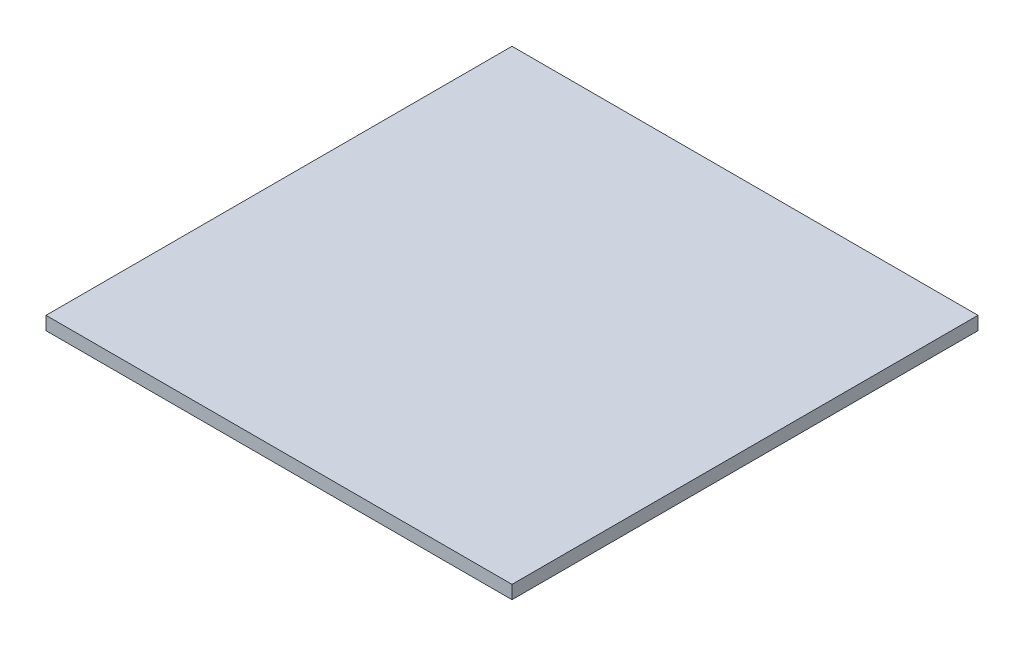
ISO-10303-21;
HEADER;
FILE_DESCRIPTION(('STEP AP214'),'2;1');
FILE_NAME('part.step','',(''),(''),'','','');
FILE_SCHEMA(('AUTOMOTIVE_DESIGN { 1 0 10303 214 1 1 1 1 }'));
ENDSEC;
DATA;
#1=APPLICATION_CONTEXT('core data for automotive mechanical design processes');
#2=APPLICATION_PROTOCOL_DEFINITION('international standard','automotive_design',2000,#1);
#3=PRODUCT_CONTEXT('',#1,'mechanical');
#4=PRODUCT('Part','Part','',(#3));
#5=PRODUCT_RELATED_PRODUCT_CATEGORY('part','',(#4));
#6=PRODUCT_DEFINITION_FORMATION('','',#4);
#7=PRODUCT_DEFINITION_CONTEXT('part definition',#1,'design');
#8=PRODUCT_DEFINITION('design','',#6,#7);
#9=PRODUCT_DEFINITION_SHAPE('','',#8);
#10=(LENGTH_UNIT() NAMED_UNIT(*) SI_UNIT(.MILLI.,.METRE.));
#11=(NAMED_UNIT(*) PLANE_ANGLE_UNIT() SI_UNIT($,.RADIAN.));
#12=(NAMED_UNIT(*) SI_UNIT($,.STERADIAN.) SOLID_ANGLE_UNIT());
#13=UNCERTAINTY_MEASURE_WITH_UNIT(LENGTH_MEASURE(1.E-05),#10,'distance_accuracy_value','');
#14=(GEOMETRIC_REPRESENTATION_CONTEXT(3) GLOBAL_UNCERTAINTY_ASSIGNED_CONTEXT((#13)) GLOBAL_UNIT_ASSIGNED_CONTEXT((#10,
#11,#12)) REPRESENTATION_CONTEXT('',''));
#15=CARTESIAN_POINT('',(0.,0.,0.));
#16=DIRECTION('',(0.,0.,1.));
#17=DIRECTION('',(1.,0.,0.));
#18=AXIS2_PLACEMENT_3D('',#15,#16,#17);
#19=CARTESIAN_POINT('',(0.,10.,0.));
#20=DIRECTION('',(1.,0.,0.));
#21=DIRECTION('',(0.,0.,-1.));
#22=AXIS2_PLACEMENT_3D('',#19,#20,#21);
#23=PLANE('',#22);
#24=DIRECTION('',(0.,0.,1.));
#25=VECTOR('',#24,1.);
#26=CARTESIAN_POINT('',(0.,0.,0.));
#27=LINE('',#26,#25);
#28=CARTESIAN_POINT('',(0.,0.,-350.));
#29=VERTEX_POINT('',#28);
#30=CARTESIAN_POINT('',(0.,0.,0.));
#31=VERTEX_POINT('',#30);
#32=EDGE_CURVE('E94',#29,#31,#27,.T.);
#33=ORIENTED_EDGE('',*,*,#32,.T.);
#34=DIRECTION('',(0.,-1.,0.));
#35=VECTOR('',#34,1.);
#36=CARTESIAN_POINT('',(0.,10.,0.));
#37=LINE('',#36,#35);
#38=CARTESIAN_POINT('',(0.,10.,0.));
#39=VERTEX_POINT('',#38);
#40=EDGE_CURVE('E11',#39,#31,#37,.T.);
#41=ORIENTED_EDGE('',*,*,#40,.F.);
#42=DIRECTION('',(0.,0.,1.));
#43=VECTOR('',#42,1.);
#44=CARTESIAN_POINT('',(0.,10.,0.));
#45=LINE('',#44,#43);
#46=CARTESIAN_POINT('',(0.,10.,-350.));
#47=VERTEX_POINT('',#46);
#48=EDGE_CURVE('E82',#47,#39,#45,.T.);
#49=ORIENTED_EDGE('',*,*,#48,.F.);
#50=DIRECTION('',(0.,-1.,0.));
#51=VECTOR('',#50,1.);
#52=CARTESIAN_POINT('',(0.,10.,-350.));
#53=LINE('',#52,#51);
#54=EDGE_CURVE('E90',#47,#29,#53,.T.);
#55=ORIENTED_EDGE('',*,*,#54,.T.);
#56=EDGE_LOOP('',(#33,#41,#49,#55));
#57=FACE_BOUND('',#56,.T.);
#58=ADVANCED_FACE('F31',(#57),#23,.F.);
#59=CARTESIAN_POINT('',(0.,10.,0.));
#60=DIRECTION('',(0.,0.,-1.));
#61=DIRECTION('',(-1.,0.,0.));
#62=AXIS2_PLACEMENT_3D('',#59,#60,#61);
#63=PLANE('',#62);
#64=DIRECTION('',(1.,0.,0.));
#65=VECTOR('',#64,1.);
#66=CARTESIAN_POINT('',(0.,0.,0.));
#67=LINE('',#66,#65);
#68=CARTESIAN_POINT('',(350.,0.,0.));
#69=VERTEX_POINT('',#68);
#70=EDGE_CURVE('E86',#31,#69,#67,.T.);
#71=ORIENTED_EDGE('',*,*,#70,.T.);
#72=DIRECTION('',(0.,-1.,0.));
#73=VECTOR('',#72,1.);
#74=CARTESIAN_POINT('',(350.,10.,0.));
#75=LINE('',#74,#73);
#76=CARTESIAN_POINT('',(350.,10.,0.));
#77=VERTEX_POINT('',#76);
#78=EDGE_CURVE('E39',#77,#69,#75,.T.);
#79=ORIENTED_EDGE('',*,*,#78,.F.);
#80=DIRECTION('',(1.,0.,0.));
#81=VECTOR('',#80,1.);
#82=CARTESIAN_POINT('',(0.,10.,0.));
#83=LINE('',#82,#81);
#84=EDGE_CURVE('E77',#39,#77,#83,.T.);
#85=ORIENTED_EDGE('',*,*,#84,.F.);
#86=ORIENTED_EDGE('',*,*,#40,.T.);
#87=EDGE_LOOP('',(#71,#79,#85,#86));
#88=FACE_BOUND('',#87,.T.);
#89=ADVANCED_FACE('F85',(#88),#63,.F.);
#90=CARTESIAN_POINT('',(350.,10.,0.));
#91=DIRECTION('',(-1.,0.,0.));
#92=DIRECTION('',(0.,0.,1.));
#93=AXIS2_PLACEMENT_3D('',#90,#91,#92);
#94=PLANE('',#93);
#95=DIRECTION('',(0.,0.,-1.));
#96=VECTOR('',#95,1.);
#97=CARTESIAN_POINT('',(350.,0.,0.));
#98=LINE('',#97,#96);
#99=CARTESIAN_POINT('',(350.,0.,-350.));
#100=VERTEX_POINT('',#99);
#101=EDGE_CURVE('E64',#69,#100,#98,.T.);
#102=ORIENTED_EDGE('',*,*,#101,.T.);
#103=DIRECTION('',(0.,-1.,0.));
#104=VECTOR('',#103,1.);
#105=CARTESIAN_POINT('',(350.,10.,-350.));
#106=LINE('',#105,#104);
#107=CARTESIAN_POINT('',(350.,10.,-350.));
#108=VERTEX_POINT('',#107);
#109=EDGE_CURVE('E87',#108,#100,#106,.T.);
#110=ORIENTED_EDGE('',*,*,#109,.F.);
#111=DIRECTION('',(0.,0.,-1.));
#112=VECTOR('',#111,1.);
#113=CARTESIAN_POINT('',(350.,10.,0.));
#114=LINE('',#113,#112);
#115=EDGE_CURVE('E80',#77,#108,#114,.T.);
#116=ORIENTED_EDGE('',*,*,#115,.F.);
#117=ORIENTED_EDGE('',*,*,#78,.T.);
#118=EDGE_LOOP('',(#102,#110,#116,#117));
#119=FACE_BOUND('',#118,.T.);
#120=ADVANCED_FACE('F88',(#119),#94,.F.);
#121=CARTESIAN_POINT('',(0.,10.,-350.));
#122=DIRECTION('',(0.,0.,1.));
#123=DIRECTION('',(1.,0.,0.));
#124=AXIS2_PLACEMENT_3D('',#121,#122,#123);
#125=PLANE('',#124);
#126=DIRECTION('',(-1.,0.,0.));
#127=VECTOR('',#126,1.);
#128=CARTESIAN_POINT('',(0.,0.,-350.));
#129=LINE('',#128,#127);
#130=EDGE_CURVE('E70',#100,#29,#129,.T.);
#131=ORIENTED_EDGE('',*,*,#130,.T.);
#132=ORIENTED_EDGE('',*,*,#54,.F.);
#133=DIRECTION('',(-1.,0.,0.));
#134=VECTOR('',#133,1.);
#135=CARTESIAN_POINT('',(0.,10.,-350.));
#136=LINE('',#135,#134);
#137=EDGE_CURVE('E47',#108,#47,#136,.T.);
#138=ORIENTED_EDGE('',*,*,#137,.F.);
#139=ORIENTED_EDGE('',*,*,#109,.T.);
#140=EDGE_LOOP('',(#131,#132,#138,#139));
#141=FACE_BOUND('',#140,.T.);
#142=ADVANCED_FACE('F101',(#141),#125,.F.);
#143=CARTESIAN_POINT('',(0.,10.,-350.));
#144=DIRECTION('',(0.,-1.,0.));
#145=DIRECTION('',(0.,0.,-1.));
#146=AXIS2_PLACEMENT_3D('',#143,#144,#145);
#147=PLANE('',#146);
#148=ORIENTED_EDGE('',*,*,#48,.T.);
#149=ORIENTED_EDGE('',*,*,#84,.T.);
#150=ORIENTED_EDGE('',*,*,#115,.T.);
#151=ORIENTED_EDGE('',*,*,#137,.T.);
#152=EDGE_LOOP('',(#148,#149,#150,#151));
#153=FACE_BOUND('',#152,.T.);
#154=ADVANCED_FACE('F78',(#153),#147,.F.);
#155=CARTESIAN_POINT('',(0.,0.,-350.));
#156=DIRECTION('',(0.,-1.,0.));
#157=DIRECTION('',(0.,0.,-1.));
#158=AXIS2_PLACEMENT_3D('',#155,#156,#157);
#159=PLANE('',#158);
#160=ORIENTED_EDGE('',*,*,#32,.F.);
#161=ORIENTED_EDGE('',*,*,#130,.F.);
#162=ORIENTED_EDGE('',*,*,#101,.F.);
#163=ORIENTED_EDGE('',*,*,#70,.F.);
#164=EDGE_LOOP('',(#160,#161,#162,#163));
#165=FACE_BOUND('',#164,.T.);
#166=ADVANCED_FACE('F104',(#165),#159,.T.);
#167=CLOSED_SHELL('',(#58,#89,#120,#142,#154,#166));
#168=MANIFOLD_SOLID_BREP('B2',#167);
#169=ADVANCED_BREP_SHAPE_REPRESENTATION('',(#18,#168),#14);
#170=SHAPE_DEFINITION_REPRESENTATION(#9,#169);
ENDSEC;
END-ISO-10303-21;
